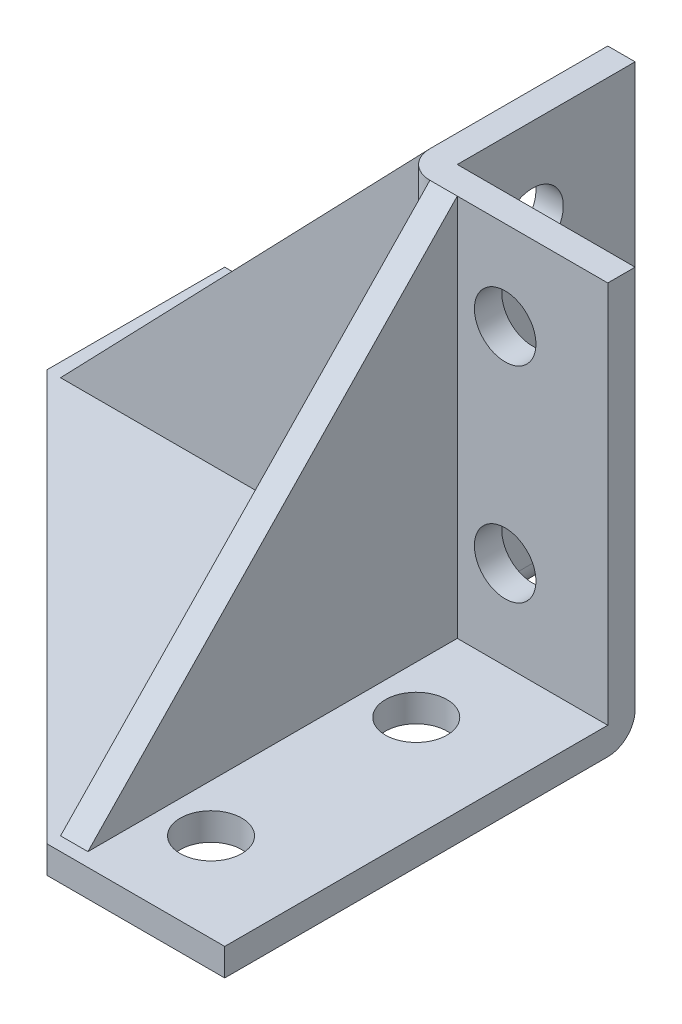
ISO-10303-21;
HEADER;
FILE_DESCRIPTION(('STEP AP214'),'2;1');
FILE_NAME('part.step','',(''),(''),'','','');
FILE_SCHEMA(('AUTOMOTIVE_DESIGN { 1 0 10303 214 1 1 1 1 }'));
ENDSEC;
DATA;
#1=APPLICATION_CONTEXT('core data for automotive mechanical design processes');
#2=APPLICATION_PROTOCOL_DEFINITION('international standard','automotive_design',2000,#1);
#3=PRODUCT_CONTEXT('',#1,'mechanical');
#4=PRODUCT('Part','Part','',(#3));
#5=PRODUCT_RELATED_PRODUCT_CATEGORY('part','',(#4));
#6=PRODUCT_DEFINITION_FORMATION('','',#4);
#7=PRODUCT_DEFINITION_CONTEXT('part definition',#1,'design');
#8=PRODUCT_DEFINITION('design','',#6,#7);
#9=PRODUCT_DEFINITION_SHAPE('','',#8);
#10=(LENGTH_UNIT() NAMED_UNIT(*) SI_UNIT(.MILLI.,.METRE.));
#11=(NAMED_UNIT(*) PLANE_ANGLE_UNIT() SI_UNIT($,.RADIAN.));
#12=(NAMED_UNIT(*) SI_UNIT($,.STERADIAN.) SOLID_ANGLE_UNIT());
#13=UNCERTAINTY_MEASURE_WITH_UNIT(LENGTH_MEASURE(1.E-05),#10,'distance_accuracy_value','');
#14=(GEOMETRIC_REPRESENTATION_CONTEXT(3) GLOBAL_UNCERTAINTY_ASSIGNED_CONTEXT((#13)) GLOBAL_UNIT_ASSIGNED_CONTEXT((#10,
#11,#12)) REPRESENTATION_CONTEXT('',''));
#15=CARTESIAN_POINT('',(0.,0.,0.));
#16=DIRECTION('',(0.,0.,1.));
#17=DIRECTION('',(1.,0.,0.));
#18=AXIS2_PLACEMENT_3D('',#15,#16,#17);
#19=CARTESIAN_POINT('',(0.,6.35,0.));
#20=DIRECTION('',(0.,-1.,0.));
#21=DIRECTION('',(0.,0.,-1.));
#22=AXIS2_PLACEMENT_3D('',#19,#20,#21);
#23=PLANE('',#22);
#24=CARTESIAN_POINT('',(-23.8125,6.35,115.8875));
#25=DIRECTION('',(0.,1.,0.));
#26=DIRECTION('',(0.,0.,1.));
#27=AXIS2_PLACEMENT_3D('',#24,#25,#26);
#28=CIRCLE('',#27,7.14374999999999);
#29=CARTESIAN_POINT('',(-23.8125,6.35,123.03125));
#30=VERTEX_POINT('',#29);
#31=EDGE_CURVE('E289',#30,#30,#28,.T.);
#32=ORIENTED_EDGE('',*,*,#31,.F.);
#33=EDGE_LOOP('',(#32));
#34=FACE_BOUND('',#33,.T.);
#35=CARTESIAN_POINT('',(-68.2625,6.35,23.8125));
#36=DIRECTION('',(0.,1.,0.));
#37=DIRECTION('',(0.,0.,1.));
#38=AXIS2_PLACEMENT_3D('',#35,#36,#37);
#39=CIRCLE('',#38,7.14375);
#40=CARTESIAN_POINT('',(-68.2625,6.35,30.95625));
#41=VERTEX_POINT('',#40);
#42=EDGE_CURVE('E592',#41,#41,#39,.T.);
#43=ORIENTED_EDGE('',*,*,#42,.F.);
#44=EDGE_LOOP('',(#43));
#45=FACE_BOUND('',#44,.T.);
#46=CARTESIAN_POINT('',(-115.8875,6.35,23.8125));
#47=DIRECTION('',(0.,1.,0.));
#48=DIRECTION('',(0.,0.,1.));
#49=AXIS2_PLACEMENT_3D('',#46,#47,#48);
#50=CIRCLE('',#49,7.14374999999999);
#51=CARTESIAN_POINT('',(-115.8875,6.35,30.95625));
#52=VERTEX_POINT('',#51);
#53=EDGE_CURVE('E578',#52,#52,#50,.T.);
#54=ORIENTED_EDGE('',*,*,#53,.F.);
#55=EDGE_LOOP('',(#54));
#56=FACE_BOUND('',#55,.T.);
#57=DIRECTION('',(-1.,0.,0.));
#58=VECTOR('',#57,1.);
#59=CARTESIAN_POINT('',(-34.9249999999999,6.35,133.35));
#60=LINE('',#59,#58);
#61=CARTESIAN_POINT('',(-34.925,6.35,133.35));
#62=VERTEX_POINT('',#61);
#63=CARTESIAN_POINT('',(-41.2749999999999,6.35,133.35));
#64=VERTEX_POINT('',#63);
#65=EDGE_CURVE('E211',#62,#64,#60,.T.);
#66=ORIENTED_EDGE('',*,*,#65,.T.);
#67=DIRECTION('',(0.,0.,-1.));
#68=VECTOR('',#67,1.);
#69=CARTESIAN_POINT('',(-41.275,6.35,47.625));
#70=LINE('',#69,#68);
#71=CARTESIAN_POINT('',(-41.275,6.35,47.625));
#72=VERTEX_POINT('',#71);
#73=EDGE_CURVE('E191',#64,#72,#70,.T.);
#74=ORIENTED_EDGE('',*,*,#73,.T.);
#75=CARTESIAN_POINT('',(-41.275,6.34999999999999,41.275));
#76=DIRECTION('',(0.,-1.,0.));
#77=DIRECTION('',(0.,0.,-1.));
#78=AXIS2_PLACEMENT_3D('',#75,#76,#77);
#79=CIRCLE('',#78,6.35);
#80=CARTESIAN_POINT('',(-47.625,6.35,41.275));
#81=VERTEX_POINT('',#80);
#82=EDGE_CURVE('E12',#72,#81,#79,.T.);
#83=ORIENTED_EDGE('',*,*,#82,.T.);
#84=DIRECTION('',(1.,0.,0.));
#85=VECTOR('',#84,1.);
#86=CARTESIAN_POINT('',(-47.625,6.35,41.275));
#87=LINE('',#86,#85);
#88=CARTESIAN_POINT('',(-133.35,6.35,41.275));
#89=VERTEX_POINT('',#88);
#90=EDGE_CURVE('E507',#89,#81,#87,.T.);
#91=ORIENTED_EDGE('',*,*,#90,.F.);
#92=DIRECTION('',(0.,0.,1.));
#93=VECTOR('',#92,1.);
#94=CARTESIAN_POINT('',(-133.35,6.35,34.925));
#95=LINE('',#94,#93);
#96=CARTESIAN_POINT('',(-133.35,6.35,34.925));
#97=VERTEX_POINT('',#96);
#98=EDGE_CURVE('E503',#97,#89,#95,.T.);
#99=ORIENTED_EDGE('',*,*,#98,.F.);
#100=DIRECTION('',(-1.,0.,0.));
#101=VECTOR('',#100,1.);
#102=CARTESIAN_POINT('',(-47.625,6.35,34.925));
#103=LINE('',#102,#101);
#104=CARTESIAN_POINT('',(-47.625,6.35,34.925));
#105=VERTEX_POINT('',#104);
#106=EDGE_CURVE('E495',#105,#97,#103,.T.);
#107=ORIENTED_EDGE('',*,*,#106,.F.);
#108=DIRECTION('',(0.,0.,1.));
#109=VECTOR('',#108,1.);
#110=CARTESIAN_POINT('',(-47.625,6.35,0.));
#111=LINE('',#110,#109);
#112=CARTESIAN_POINT('',(-47.625,6.35,0.));
#113=VERTEX_POINT('',#112);
#114=EDGE_CURVE('E368',#113,#105,#111,.T.);
#115=ORIENTED_EDGE('',*,*,#114,.F.);
#116=DIRECTION('',(-1.,0.,0.));
#117=VECTOR('',#116,1.);
#118=CARTESIAN_POINT('',(-136.525,6.35,0.));
#119=LINE('',#118,#117);
#120=CARTESIAN_POINT('',(-136.525,6.35,0.));
#121=VERTEX_POINT('',#120);
#122=EDGE_CURVE('E383',#113,#121,#119,.T.);
#123=ORIENTED_EDGE('',*,*,#122,.T.);
#124=DIRECTION('',(0.,0.,1.));
#125=VECTOR('',#124,1.);
#126=CARTESIAN_POINT('',(-136.525,6.35,41.275));
#127=LINE('',#126,#125);
#128=CARTESIAN_POINT('',(-136.525,6.35,41.275));
#129=VERTEX_POINT('',#128);
#130=EDGE_CURVE('E372',#121,#129,#127,.T.);
#131=ORIENTED_EDGE('',*,*,#130,.T.);
#132=DIRECTION('',(0.707106781186548,0.,0.707106781186547));
#133=VECTOR('',#132,1.);
#134=CARTESIAN_POINT('',(-41.275,6.35,136.525));
#135=LINE('',#134,#133);
#136=CARTESIAN_POINT('',(-41.275,6.35,136.525));
#137=VERTEX_POINT('',#136);
#138=EDGE_CURVE('E375',#129,#137,#135,.T.);
#139=ORIENTED_EDGE('',*,*,#138,.T.);
#140=DIRECTION('',(1.,0.,0.));
#141=VECTOR('',#140,1.);
#142=CARTESIAN_POINT('',(0.,6.35,136.525));
#143=LINE('',#142,#141);
#144=CARTESIAN_POINT('',(0.,6.35,136.525));
#145=VERTEX_POINT('',#144);
#146=EDGE_CURVE('E378',#137,#145,#143,.T.);
#147=ORIENTED_EDGE('',*,*,#146,.T.);
#148=DIRECTION('',(0.,0.,-1.));
#149=VECTOR('',#148,1.);
#150=CARTESIAN_POINT('',(0.,6.35,41.275));
#151=LINE('',#150,#149);
#152=CARTESIAN_POINT('',(0.,6.35,47.625));
#153=VERTEX_POINT('',#152);
#154=EDGE_CURVE('E380',#145,#153,#151,.T.);
#155=ORIENTED_EDGE('',*,*,#154,.T.);
#156=DIRECTION('',(-1.,0.,0.));
#157=VECTOR('',#156,1.);
#158=CARTESIAN_POINT('',(-41.275,6.35,47.625));
#159=LINE('',#158,#157);
#160=CARTESIAN_POINT('',(-34.925,6.35,47.625));
#161=VERTEX_POINT('',#160);
#162=EDGE_CURVE('E365',#153,#161,#159,.T.);
#163=ORIENTED_EDGE('',*,*,#162,.T.);
#164=DIRECTION('',(0.,0.,1.));
#165=VECTOR('',#164,1.);
#166=CARTESIAN_POINT('',(-34.925,6.35,47.625));
#167=LINE('',#166,#165);
#168=EDGE_CURVE('E209',#161,#62,#167,.T.);
#169=ORIENTED_EDGE('',*,*,#168,.T.);
#170=EDGE_LOOP('',(#66,#74,#83,#91,#99,#107,#115,#123,#131,#139,#147,#155,#163,#169));
#171=FACE_BOUND('',#170,.T.);
#172=CARTESIAN_POINT('',(-23.8125,6.35,68.2625));
#173=DIRECTION('',(0.,1.,0.));
#174=DIRECTION('',(0.,0.,1.));
#175=AXIS2_PLACEMENT_3D('',#172,#173,#174);
#176=CIRCLE('',#175,7.14374999999999);
#177=CARTESIAN_POINT('',(-23.8125,6.35,75.40625));
#178=VERTEX_POINT('',#177);
#179=EDGE_CURVE('E295',#178,#178,#176,.T.);
#180=ORIENTED_EDGE('',*,*,#179,.F.);
#181=EDGE_LOOP('',(#180));
#182=FACE_BOUND('',#181,.T.);
#183=ADVANCED_FACE('F48',(#34,#45,#56,#171,#182),#23,.F.);
#184=CARTESIAN_POINT('',(0.,0.,0.));
#185=DIRECTION('',(0.,-1.,0.));
#186=DIRECTION('',(0.,0.,-1.));
#187=AXIS2_PLACEMENT_3D('',#184,#185,#186);
#188=PLANE('',#187);
#189=CARTESIAN_POINT('',(-23.8125,0.,68.2625));
#190=DIRECTION('',(0.,1.,0.));
#191=DIRECTION('',(0.,0.,1.));
#192=AXIS2_PLACEMENT_3D('',#189,#190,#191);
#193=CIRCLE('',#192,7.14374999999999);
#194=CARTESIAN_POINT('',(-23.8125,0.,75.40625));
#195=VERTEX_POINT('',#194);
#196=EDGE_CURVE('E292',#195,#195,#193,.T.);
#197=ORIENTED_EDGE('',*,*,#196,.T.);
#198=EDGE_LOOP('',(#197));
#199=FACE_BOUND('',#198,.T.);
#200=DIRECTION('',(0.,0.,-1.));
#201=VECTOR('',#200,1.);
#202=CARTESIAN_POINT('',(-47.625,0.,41.275));
#203=LINE('',#202,#201);
#204=CARTESIAN_POINT('',(-47.625,0.,0.));
#205=VERTEX_POINT('',#204);
#206=CARTESIAN_POINT('',(-47.625,0.,47.625));
#207=VERTEX_POINT('',#206);
#208=EDGE_CURVE('E73',#205,#207,#203,.F.);
#209=ORIENTED_EDGE('',*,*,#208,.T.);
#210=DIRECTION('',(-1.,0.,0.));
#211=VECTOR('',#210,1.);
#212=CARTESIAN_POINT('',(0.,0.,47.625));
#213=LINE('',#212,#211);
#214=CARTESIAN_POINT('',(0.,0.,47.625));
#215=VERTEX_POINT('',#214);
#216=EDGE_CURVE('E317',#207,#215,#213,.F.);
#217=ORIENTED_EDGE('',*,*,#216,.T.);
#218=DIRECTION('',(0.,0.,-1.));
#219=VECTOR('',#218,1.);
#220=CARTESIAN_POINT('',(0.,0.,41.275));
#221=LINE('',#220,#219);
#222=CARTESIAN_POINT('',(0.,0.,136.525));
#223=VERTEX_POINT('',#222);
#224=EDGE_CURVE('E411',#223,#215,#221,.T.);
#225=ORIENTED_EDGE('',*,*,#224,.F.);
#226=DIRECTION('',(1.,0.,0.));
#227=VECTOR('',#226,1.);
#228=CARTESIAN_POINT('',(0.,0.,136.525));
#229=LINE('',#228,#227);
#230=CARTESIAN_POINT('',(-41.275,0.,136.525));
#231=VERTEX_POINT('',#230);
#232=EDGE_CURVE('E406',#231,#223,#229,.T.);
#233=ORIENTED_EDGE('',*,*,#232,.F.);
#234=DIRECTION('',(0.707106781186548,0.,0.707106781186547));
#235=VECTOR('',#234,1.);
#236=CARTESIAN_POINT('',(-41.275,0.,136.525));
#237=LINE('',#236,#235);
#238=CARTESIAN_POINT('',(-136.525,0.,41.275));
#239=VERTEX_POINT('',#238);
#240=EDGE_CURVE('E401',#239,#231,#237,.T.);
#241=ORIENTED_EDGE('',*,*,#240,.F.);
#242=DIRECTION('',(0.,0.,1.));
#243=VECTOR('',#242,1.);
#244=CARTESIAN_POINT('',(-136.525,0.,41.275));
#245=LINE('',#244,#243);
#246=CARTESIAN_POINT('',(-136.525,0.,0.));
#247=VERTEX_POINT('',#246);
#248=EDGE_CURVE('E386',#247,#239,#245,.T.);
#249=ORIENTED_EDGE('',*,*,#248,.F.);
#250=DIRECTION('',(-1.,0.,0.));
#251=VECTOR('',#250,1.);
#252=CARTESIAN_POINT('',(-136.525,0.,0.));
#253=LINE('',#252,#251);
#254=EDGE_CURVE('E376',#205,#247,#253,.T.);
#255=ORIENTED_EDGE('',*,*,#254,.F.);
#256=EDGE_LOOP('',(#209,#217,#225,#233,#241,#249,#255));
#257=FACE_BOUND('',#256,.T.);
#258=CARTESIAN_POINT('',(-115.8875,0.,23.8125));
#259=DIRECTION('',(0.,-1.,0.));
#260=DIRECTION('',(0.,0.,-1.));
#261=AXIS2_PLACEMENT_3D('',#258,#259,#260);
#262=CIRCLE('',#261,7.14374999999999);
#263=CARTESIAN_POINT('',(-115.8875,0.,16.66875));
#264=VERTEX_POINT('',#263);
#265=EDGE_CURVE('E575',#264,#264,#262,.T.);
#266=ORIENTED_EDGE('',*,*,#265,.F.);
#267=EDGE_LOOP('',(#266));
#268=FACE_BOUND('',#267,.T.);
#269=CARTESIAN_POINT('',(-68.2625,0.,23.8125));
#270=DIRECTION('',(0.,-1.,0.));
#271=DIRECTION('',(0.,0.,-1.));
#272=AXIS2_PLACEMENT_3D('',#269,#270,#271);
#273=CIRCLE('',#272,7.14374999999999);
#274=CARTESIAN_POINT('',(-68.2625,0.,16.66875));
#275=VERTEX_POINT('',#274);
#276=EDGE_CURVE('E589',#275,#275,#273,.T.);
#277=ORIENTED_EDGE('',*,*,#276,.F.);
#278=EDGE_LOOP('',(#277));
#279=FACE_BOUND('',#278,.T.);
#280=CARTESIAN_POINT('',(-23.8125,0.,115.8875));
#281=DIRECTION('',(0.,1.,0.));
#282=DIRECTION('',(0.,0.,1.));
#283=AXIS2_PLACEMENT_3D('',#280,#281,#282);
#284=CIRCLE('',#283,7.14374999999999);
#285=CARTESIAN_POINT('',(-23.8125,0.,123.03125));
#286=VERTEX_POINT('',#285);
#287=EDGE_CURVE('E223',#286,#286,#284,.T.);
#288=ORIENTED_EDGE('',*,*,#287,.T.);
#289=EDGE_LOOP('',(#288));
#290=FACE_BOUND('',#289,.T.);
#291=ADVANCED_FACE('F433',(#199,#257,#268,#279,#290),#188,.T.);
#292=CARTESIAN_POINT('',(-41.275,6.35,0.));
#293=DIRECTION('',(-1.,0.,0.));
#294=DIRECTION('',(0.,0.,1.));
#295=AXIS2_PLACEMENT_3D('',#292,#293,#294);
#296=PLANE('',#295);
#297=CARTESIAN_POINT('',(-41.275,26.9875,23.8125));
#298=DIRECTION('',(-1.,0.,0.));
#299=DIRECTION('',(0.,0.,1.));
#300=AXIS2_PLACEMENT_3D('',#297,#298,#299);
#301=CIRCLE('',#300,7.14374999999999);
#302=CARTESIAN_POINT('',(-41.275,26.9875,30.95625));
#303=VERTEX_POINT('',#302);
#304=EDGE_CURVE('E583',#303,#303,#301,.T.);
#305=ORIENTED_EDGE('',*,*,#304,.T.);
#306=EDGE_LOOP('',(#305));
#307=FACE_BOUND('',#306,.T.);
#308=CARTESIAN_POINT('',(-41.275,74.6125,23.8125));
#309=DIRECTION('',(-1.,0.,0.));
#310=DIRECTION('',(0.,0.,1.));
#311=AXIS2_PLACEMENT_3D('',#308,#309,#310);
#312=CIRCLE('',#311,7.14374999999999);
#313=CARTESIAN_POINT('',(-41.275,74.6125,30.95625));
#314=VERTEX_POINT('',#313);
#315=EDGE_CURVE('E363',#314,#314,#312,.T.);
#316=ORIENTED_EDGE('',*,*,#315,.T.);
#317=EDGE_LOOP('',(#316));
#318=FACE_BOUND('',#317,.T.);
#319=DIRECTION('',(0.,-1.,0.));
#320=VECTOR('',#319,1.);
#321=CARTESIAN_POINT('',(-41.275,6.35,41.275));
#322=LINE('',#321,#320);
#323=CARTESIAN_POINT('',(-41.275,95.25,41.275));
#324=VERTEX_POINT('',#323);
#325=CARTESIAN_POINT('',(-41.275,6.35,41.275));
#326=VERTEX_POINT('',#325);
#327=EDGE_CURVE('E326',#324,#326,#322,.T.);
#328=ORIENTED_EDGE('',*,*,#327,.T.);
#329=DIRECTION('',(0.,0.,-1.));
#330=VECTOR('',#329,1.);
#331=CARTESIAN_POINT('',(-41.275,6.35,0.));
#332=LINE('',#331,#330);
#333=CARTESIAN_POINT('',(-41.275,6.35,0.));
#334=VERTEX_POINT('',#333);
#335=EDGE_CURVE('E65',#326,#334,#332,.T.);
#336=ORIENTED_EDGE('',*,*,#335,.T.);
#337=DIRECTION('',(0.,-1.,0.));
#338=VECTOR('',#337,1.);
#339=CARTESIAN_POINT('',(-41.275,6.35,0.));
#340=LINE('',#339,#338);
#341=CARTESIAN_POINT('',(-41.275,95.25,0.));
#342=VERTEX_POINT('',#341);
#343=EDGE_CURVE('E334',#342,#334,#340,.T.);
#344=ORIENTED_EDGE('',*,*,#343,.F.);
#345=DIRECTION('',(0.,0.,1.));
#346=VECTOR('',#345,1.);
#347=CARTESIAN_POINT('',(-41.275,95.25,0.));
#348=LINE('',#347,#346);
#349=EDGE_CURVE('E333',#342,#324,#348,.T.);
#350=ORIENTED_EDGE('',*,*,#349,.T.);
#351=EDGE_LOOP('',(#328,#336,#344,#350));
#352=FACE_BOUND('',#351,.T.);
#353=ADVANCED_FACE('F331',(#307,#318,#352),#296,.F.);
#354=CARTESIAN_POINT('',(-136.525,6.35,41.275));
#355=DIRECTION('',(1.,0.,0.));
#356=DIRECTION('',(0.,0.,-1.));
#357=AXIS2_PLACEMENT_3D('',#354,#355,#356);
#358=PLANE('',#357);
#359=ORIENTED_EDGE('',*,*,#248,.T.);
#360=DIRECTION('',(0.,-1.,0.));
#361=VECTOR('',#360,1.);
#362=CARTESIAN_POINT('',(-136.525,6.35,41.275));
#363=LINE('',#362,#361);
#364=EDGE_CURVE('E180',#129,#239,#363,.T.);
#365=ORIENTED_EDGE('',*,*,#364,.F.);
#366=ORIENTED_EDGE('',*,*,#130,.F.);
#367=DIRECTION('',(0.,-1.,0.));
#368=VECTOR('',#367,1.);
#369=CARTESIAN_POINT('',(-136.525,6.35,0.));
#370=LINE('',#369,#368);
#371=EDGE_CURVE('E338',#121,#247,#370,.T.);
#372=ORIENTED_EDGE('',*,*,#371,.T.);
#373=EDGE_LOOP('',(#359,#365,#366,#372));
#374=FACE_BOUND('',#373,.T.);
#375=ADVANCED_FACE('F425',(#374),#358,.F.);
#376=CARTESIAN_POINT('',(-41.275,6.35,136.525));
#377=DIRECTION('',(0.707106781186547,0.,-0.707106781186548));
#378=DIRECTION('',(-0.707106781186548,0.,-0.707106781186547));
#379=AXIS2_PLACEMENT_3D('',#376,#377,#378);
#380=PLANE('',#379);
#381=ORIENTED_EDGE('',*,*,#240,.T.);
#382=DIRECTION('',(0.,-1.,0.));
#383=VECTOR('',#382,1.);
#384=CARTESIAN_POINT('',(-41.275,6.35,136.525));
#385=LINE('',#384,#383);
#386=EDGE_CURVE('E419',#137,#231,#385,.T.);
#387=ORIENTED_EDGE('',*,*,#386,.F.);
#388=ORIENTED_EDGE('',*,*,#138,.F.);
#389=ORIENTED_EDGE('',*,*,#364,.T.);
#390=EDGE_LOOP('',(#381,#387,#388,#389));
#391=FACE_BOUND('',#390,.T.);
#392=ADVANCED_FACE('F423',(#391),#380,.F.);
#393=CARTESIAN_POINT('',(0.,6.35,136.525));
#394=DIRECTION('',(0.,0.,-1.));
#395=DIRECTION('',(-1.,0.,0.));
#396=AXIS2_PLACEMENT_3D('',#393,#394,#395);
#397=PLANE('',#396);
#398=ORIENTED_EDGE('',*,*,#232,.T.);
#399=DIRECTION('',(0.,-1.,0.));
#400=VECTOR('',#399,1.);
#401=CARTESIAN_POINT('',(0.,6.35,136.525));
#402=LINE('',#401,#400);
#403=EDGE_CURVE('E336',#145,#223,#402,.T.);
#404=ORIENTED_EDGE('',*,*,#403,.F.);
#405=ORIENTED_EDGE('',*,*,#146,.F.);
#406=ORIENTED_EDGE('',*,*,#386,.T.);
#407=EDGE_LOOP('',(#398,#404,#405,#406));
#408=FACE_BOUND('',#407,.T.);
#409=ADVANCED_FACE('F447',(#408),#397,.F.);
#410=CARTESIAN_POINT('',(0.,6.35,41.275));
#411=DIRECTION('',(-1.,0.,0.));
#412=DIRECTION('',(0.,0.,1.));
#413=AXIS2_PLACEMENT_3D('',#410,#411,#412);
#414=PLANE('',#413);
#415=ORIENTED_EDGE('',*,*,#224,.T.);
#416=CARTESIAN_POINT('',(0.,6.35,47.625));
#417=DIRECTION('',(-1.,0.,0.));
#418=DIRECTION('',(0.,0.,1.));
#419=AXIS2_PLACEMENT_3D('',#416,#417,#418);
#420=CIRCLE('',#419,6.35);
#421=CARTESIAN_POINT('',(0.,6.35,41.275));
#422=VERTEX_POINT('',#421);
#423=EDGE_CURVE('E320',#215,#422,#420,.F.);
#424=ORIENTED_EDGE('',*,*,#423,.T.);
#425=DIRECTION('',(0.,-1.,0.));
#426=VECTOR('',#425,1.);
#427=CARTESIAN_POINT('',(0.,6.35,41.275));
#428=LINE('',#427,#426);
#429=CARTESIAN_POINT('',(0.,95.25,41.275));
#430=VERTEX_POINT('',#429);
#431=EDGE_CURVE('E328',#430,#422,#428,.T.);
#432=ORIENTED_EDGE('',*,*,#431,.F.);
#433=DIRECTION('',(0.,0.,1.));
#434=VECTOR('',#433,1.);
#435=CARTESIAN_POINT('',(0.,95.25,41.275));
#436=LINE('',#435,#434);
#437=CARTESIAN_POINT('',(0.,95.25,47.625));
#438=VERTEX_POINT('',#437);
#439=EDGE_CURVE('E452',#430,#438,#436,.T.);
#440=ORIENTED_EDGE('',*,*,#439,.T.);
#441=DIRECTION('',(0.,-1.,0.));
#442=VECTOR('',#441,1.);
#443=CARTESIAN_POINT('',(0.,95.25,47.625));
#444=LINE('',#443,#442);
#445=EDGE_CURVE('E450',#438,#153,#444,.T.);
#446=ORIENTED_EDGE('',*,*,#445,.T.);
#447=ORIENTED_EDGE('',*,*,#154,.F.);
#448=ORIENTED_EDGE('',*,*,#403,.T.);
#449=EDGE_LOOP('',(#415,#424,#432,#440,#446,#447,#448));
#450=FACE_BOUND('',#449,.T.);
#451=ADVANCED_FACE('F442',(#450),#414,.F.);
#452=CARTESIAN_POINT('',(-41.275,6.35,41.275));
#453=DIRECTION('',(0.,0.,1.));
#454=DIRECTION('',(1.,0.,0.));
#455=AXIS2_PLACEMENT_3D('',#452,#453,#454);
#456=PLANE('',#455);
#457=CARTESIAN_POINT('',(-23.8125,74.6125,41.275));
#458=DIRECTION('',(0.,0.,1.));
#459=DIRECTION('',(1.,0.,0.));
#460=AXIS2_PLACEMENT_3D('',#457,#458,#459);
#461=CIRCLE('',#460,7.14374999999999);
#462=CARTESIAN_POINT('',(-16.66875,74.6125,41.275));
#463=VERTEX_POINT('',#462);
#464=EDGE_CURVE('E304',#463,#463,#461,.T.);
#465=ORIENTED_EDGE('',*,*,#464,.T.);
#466=EDGE_LOOP('',(#465));
#467=FACE_BOUND('',#466,.T.);
#468=CARTESIAN_POINT('',(-23.8125,26.9875,41.275));
#469=DIRECTION('',(0.,0.,1.));
#470=DIRECTION('',(1.,0.,0.));
#471=AXIS2_PLACEMENT_3D('',#468,#469,#470);
#472=CIRCLE('',#471,7.14374999999999);
#473=CARTESIAN_POINT('',(-16.66875,26.9875,41.275));
#474=VERTEX_POINT('',#473);
#475=EDGE_CURVE('E298',#474,#474,#472,.T.);
#476=ORIENTED_EDGE('',*,*,#475,.T.);
#477=EDGE_LOOP('',(#476));
#478=FACE_BOUND('',#477,.T.);
#479=ORIENTED_EDGE('',*,*,#431,.T.);
#480=DIRECTION('',(-1.,0.,0.));
#481=VECTOR('',#480,1.);
#482=CARTESIAN_POINT('',(-41.275,6.35,41.275));
#483=LINE('',#482,#481);
#484=EDGE_CURVE('E179',#422,#326,#483,.T.);
#485=ORIENTED_EDGE('',*,*,#484,.T.);
#486=ORIENTED_EDGE('',*,*,#327,.F.);
#487=DIRECTION('',(-1.,0.,0.));
#488=VECTOR('',#487,1.);
#489=CARTESIAN_POINT('',(0.,95.25,41.275));
#490=LINE('',#489,#488);
#491=EDGE_CURVE('E453',#430,#324,#490,.T.);
#492=ORIENTED_EDGE('',*,*,#491,.F.);
#493=EDGE_LOOP('',(#479,#485,#486,#492));
#494=FACE_BOUND('',#493,.T.);
#495=ADVANCED_FACE('F324',(#467,#478,#494),#456,.F.);
#496=CARTESIAN_POINT('',(-136.525,6.35,0.));
#497=DIRECTION('',(0.,0.,1.));
#498=DIRECTION('',(1.,0.,0.));
#499=AXIS2_PLACEMENT_3D('',#496,#497,#498);
#500=PLANE('',#499);
#501=ORIENTED_EDGE('',*,*,#343,.T.);
#502=CARTESIAN_POINT('',(-47.625,6.35,0.));
#503=DIRECTION('',(0.,0.,1.));
#504=DIRECTION('',(1.,0.,0.));
#505=AXIS2_PLACEMENT_3D('',#502,#503,#504);
#506=CIRCLE('',#505,6.35);
#507=EDGE_CURVE('E57',#334,#205,#506,.F.);
#508=ORIENTED_EDGE('',*,*,#507,.T.);
#509=ORIENTED_EDGE('',*,*,#254,.T.);
#510=ORIENTED_EDGE('',*,*,#371,.F.);
#511=ORIENTED_EDGE('',*,*,#122,.F.);
#512=DIRECTION('',(0.,-1.,0.));
#513=VECTOR('',#512,1.);
#514=CARTESIAN_POINT('',(-47.625,95.25,0.));
#515=LINE('',#514,#513);
#516=CARTESIAN_POINT('',(-47.625,95.25,0.));
#517=VERTEX_POINT('',#516);
#518=EDGE_CURVE('E396',#517,#113,#515,.T.);
#519=ORIENTED_EDGE('',*,*,#518,.F.);
#520=DIRECTION('',(-1.,0.,0.));
#521=VECTOR('',#520,1.);
#522=CARTESIAN_POINT('',(-41.275,95.25,0.));
#523=LINE('',#522,#521);
#524=EDGE_CURVE('E350',#342,#517,#523,.T.);
#525=ORIENTED_EDGE('',*,*,#524,.F.);
#526=EDGE_LOOP('',(#501,#508,#509,#510,#511,#519,#525));
#527=FACE_BOUND('',#526,.T.);
#528=ADVANCED_FACE('F432',(#527),#500,.F.);
#529=CARTESIAN_POINT('',(-47.625,95.25,0.));
#530=DIRECTION('',(1.,0.,0.));
#531=DIRECTION('',(0.,0.,-1.));
#532=AXIS2_PLACEMENT_3D('',#529,#530,#531);
#533=PLANE('',#532);
#534=CARTESIAN_POINT('',(-47.625,74.6125,23.8125));
#535=DIRECTION('',(-1.,0.,0.));
#536=DIRECTION('',(0.,0.,1.));
#537=AXIS2_PLACEMENT_3D('',#534,#535,#536);
#538=CIRCLE('',#537,7.14374999999999);
#539=CARTESIAN_POINT('',(-47.625,74.6125,30.95625));
#540=VERTEX_POINT('',#539);
#541=EDGE_CURVE('E598',#540,#540,#538,.T.);
#542=ORIENTED_EDGE('',*,*,#541,.F.);
#543=EDGE_LOOP('',(#542));
#544=FACE_BOUND('',#543,.T.);
#545=CARTESIAN_POINT('',(-47.625,26.9875,23.8125));
#546=DIRECTION('',(-1.,0.,0.));
#547=DIRECTION('',(0.,0.,1.));
#548=AXIS2_PLACEMENT_3D('',#545,#546,#547);
#549=CIRCLE('',#548,7.14375);
#550=CARTESIAN_POINT('',(-47.625,26.9875,30.95625));
#551=VERTEX_POINT('',#550);
#552=EDGE_CURVE('E595',#551,#551,#549,.T.);
#553=ORIENTED_EDGE('',*,*,#552,.F.);
#554=EDGE_LOOP('',(#553));
#555=FACE_BOUND('',#554,.T.);
#556=ORIENTED_EDGE('',*,*,#114,.T.);
#557=DIRECTION('',(0.,-1.,0.));
#558=VECTOR('',#557,1.);
#559=CARTESIAN_POINT('',(-47.625,6.35,34.925));
#560=LINE('',#559,#558);
#561=CARTESIAN_POINT('',(-47.625,95.25,34.925));
#562=VERTEX_POINT('',#561);
#563=EDGE_CURVE('E394',#562,#105,#560,.T.);
#564=ORIENTED_EDGE('',*,*,#563,.F.);
#565=DIRECTION('',(0.,0.,1.));
#566=VECTOR('',#565,1.);
#567=CARTESIAN_POINT('',(-47.625,95.25,0.));
#568=LINE('',#567,#566);
#569=EDGE_CURVE('E346',#517,#562,#568,.T.);
#570=ORIENTED_EDGE('',*,*,#569,.F.);
#571=ORIENTED_EDGE('',*,*,#518,.T.);
#572=EDGE_LOOP('',(#556,#564,#570,#571));
#573=FACE_BOUND('',#572,.T.);
#574=ADVANCED_FACE('F474',(#544,#555,#573),#533,.F.);
#575=CARTESIAN_POINT('',(-41.275,95.25,47.625));
#576=DIRECTION('',(0.,0.,1.));
#577=DIRECTION('',(1.,0.,0.));
#578=AXIS2_PLACEMENT_3D('',#575,#576,#577);
#579=PLANE('',#578);
#580=CARTESIAN_POINT('',(-23.8125,74.6125,47.625));
#581=DIRECTION('',(0.,0.,1.));
#582=DIRECTION('',(1.,0.,0.));
#583=AXIS2_PLACEMENT_3D('',#580,#581,#582);
#584=CIRCLE('',#583,7.14374999999999);
#585=CARTESIAN_POINT('',(-16.66875,74.6125,47.625));
#586=VERTEX_POINT('',#585);
#587=EDGE_CURVE('E307',#586,#586,#584,.T.);
#588=ORIENTED_EDGE('',*,*,#587,.F.);
#589=EDGE_LOOP('',(#588));
#590=FACE_BOUND('',#589,.T.);
#591=CARTESIAN_POINT('',(-23.8125,26.9875,47.625));
#592=DIRECTION('',(0.,0.,1.));
#593=DIRECTION('',(1.,0.,0.));
#594=AXIS2_PLACEMENT_3D('',#591,#592,#593);
#595=CIRCLE('',#594,7.14374999999999);
#596=CARTESIAN_POINT('',(-16.66875,26.9875,47.625));
#597=VERTEX_POINT('',#596);
#598=EDGE_CURVE('E301',#597,#597,#595,.T.);
#599=ORIENTED_EDGE('',*,*,#598,.F.);
#600=EDGE_LOOP('',(#599));
#601=FACE_BOUND('',#600,.T.);
#602=DIRECTION('',(0.,-1.,0.));
#603=VECTOR('',#602,1.);
#604=CARTESIAN_POINT('',(-34.925,6.35,47.625));
#605=LINE('',#604,#603);
#606=CARTESIAN_POINT('',(-34.925,95.25,47.625));
#607=VERTEX_POINT('',#606);
#608=EDGE_CURVE('E205',#607,#161,#605,.T.);
#609=ORIENTED_EDGE('',*,*,#608,.T.);
#610=ORIENTED_EDGE('',*,*,#162,.F.);
#611=ORIENTED_EDGE('',*,*,#445,.F.);
#612=DIRECTION('',(-1.,0.,0.));
#613=VECTOR('',#612,1.);
#614=CARTESIAN_POINT('',(-41.275,95.25,47.625));
#615=LINE('',#614,#613);
#616=EDGE_CURVE('E349',#438,#607,#615,.T.);
#617=ORIENTED_EDGE('',*,*,#616,.T.);
#618=EDGE_LOOP('',(#609,#610,#611,#617));
#619=FACE_BOUND('',#618,.T.);
#620=ADVANCED_FACE('F468',(#590,#601,#619),#579,.T.);
#621=CARTESIAN_POINT('',(0.,95.25,0.));
#622=DIRECTION('',(0.,1.,0.));
#623=DIRECTION('',(0.,0.,1.));
#624=AXIS2_PLACEMENT_3D('',#621,#622,#623);
#625=PLANE('',#624);
#626=DIRECTION('',(0.,0.,-1.));
#627=VECTOR('',#626,1.);
#628=CARTESIAN_POINT('',(-47.625,95.25,41.275));
#629=LINE('',#628,#627);
#630=CARTESIAN_POINT('',(-47.625,95.25,41.275));
#631=VERTEX_POINT('',#630);
#632=EDGE_CURVE('E175',#631,#562,#629,.T.);
#633=ORIENTED_EDGE('',*,*,#632,.F.);
#634=CARTESIAN_POINT('',(-41.275,95.25,41.275));
#635=DIRECTION('',(0.,1.,0.));
#636=DIRECTION('',(0.,0.,1.));
#637=AXIS2_PLACEMENT_3D('',#634,#635,#636);
#638=CIRCLE('',#637,6.35);
#639=CARTESIAN_POINT('',(-41.275,95.25,47.625));
#640=VERTEX_POINT('',#639);
#641=EDGE_CURVE('E167',#631,#640,#638,.T.);
#642=ORIENTED_EDGE('',*,*,#641,.T.);
#643=DIRECTION('',(1.,0.,0.));
#644=VECTOR('',#643,1.);
#645=CARTESIAN_POINT('',(-41.275,95.25,47.625));
#646=LINE('',#645,#644);
#647=EDGE_CURVE('E171',#640,#607,#646,.T.);
#648=ORIENTED_EDGE('',*,*,#647,.T.);
#649=ORIENTED_EDGE('',*,*,#616,.F.);
#650=ORIENTED_EDGE('',*,*,#439,.F.);
#651=ORIENTED_EDGE('',*,*,#491,.T.);
#652=ORIENTED_EDGE('',*,*,#349,.F.);
#653=ORIENTED_EDGE('',*,*,#524,.T.);
#654=ORIENTED_EDGE('',*,*,#569,.T.);
#655=EDGE_LOOP('',(#633,#642,#648,#649,#650,#651,#652,#653,#654));
#656=FACE_BOUND('',#655,.T.);
#657=ADVANCED_FACE('F169',(#656),#625,.T.);
#658=CARTESIAN_POINT('',(-47.625,6.35,41.275));
#659=DIRECTION('',(0.,0.,1.));
#660=DIRECTION('',(0.,1.,0.));
#661=AXIS2_PLACEMENT_3D('',#658,#659,#660);
#662=PLANE('',#661);
#663=DIRECTION('',(0.,1.,0.));
#664=VECTOR('',#663,1.);
#665=CARTESIAN_POINT('',(-47.625,6.35,41.275));
#666=LINE('',#665,#664);
#667=EDGE_CURVE('E502',#81,#631,#666,.T.);
#668=ORIENTED_EDGE('',*,*,#667,.T.);
#669=DIRECTION('',(-0.694135570584232,-0.719844295420685,0.));
#670=VECTOR('',#669,1.);
#671=CARTESIAN_POINT('',(-90.4875,50.8,41.275));
#672=LINE('',#671,#670);
#673=EDGE_CURVE('E282',#631,#89,#672,.T.);
#674=ORIENTED_EDGE('',*,*,#673,.T.);
#675=ORIENTED_EDGE('',*,*,#90,.T.);
#676=EDGE_LOOP('',(#668,#674,#675));
#677=FACE_BOUND('',#676,.T.);
#678=ADVANCED_FACE('F467',(#677),#662,.T.);
#679=CARTESIAN_POINT('',(-72.2716457369464,69.6905155320555,0.));
#680=DIRECTION('',(-0.719844295420685,0.694135570584232,0.));
#681=DIRECTION('',(-0.694135570584232,-0.719844295420685,0.));
#682=AXIS2_PLACEMENT_3D('',#679,#680,#681);
#683=PLANE('',#682);
#684=DIRECTION('',(-0.694135570584232,-0.719844295420685,0.));
#685=VECTOR('',#684,1.);
#686=CARTESIAN_POINT('',(-47.625,95.25,34.925));
#687=LINE('',#686,#685);
#688=EDGE_CURVE('E523',#562,#97,#687,.T.);
#689=ORIENTED_EDGE('',*,*,#688,.T.);
#690=ORIENTED_EDGE('',*,*,#98,.T.);
#691=ORIENTED_EDGE('',*,*,#673,.F.);
#692=ORIENTED_EDGE('',*,*,#632,.T.);
#693=EDGE_LOOP('',(#689,#690,#691,#692));
#694=FACE_BOUND('',#693,.T.);
#695=ADVANCED_FACE('F529',(#694),#683,.T.);
#696=CARTESIAN_POINT('',(-47.625,95.25,34.925));
#697=DIRECTION('',(0.,0.,-1.));
#698=DIRECTION('',(0.,-1.,0.));
#699=AXIS2_PLACEMENT_3D('',#696,#697,#698);
#700=PLANE('',#699);
#701=ORIENTED_EDGE('',*,*,#563,.T.);
#702=ORIENTED_EDGE('',*,*,#106,.T.);
#703=ORIENTED_EDGE('',*,*,#688,.F.);
#704=EDGE_LOOP('',(#701,#702,#703));
#705=FACE_BOUND('',#704,.T.);
#706=ADVANCED_FACE('F469',(#705),#700,.T.);
#707=CARTESIAN_POINT('',(-115.8875,6.35,23.8125));
#708=DIRECTION('',(0.,1.,0.));
#709=DIRECTION('',(0.,0.,1.));
#710=AXIS2_PLACEMENT_3D('',#707,#708,#709);
#711=CYLINDRICAL_SURFACE('',#710,7.14374999999999);
#712=ORIENTED_EDGE('',*,*,#265,.T.);
#713=EDGE_LOOP('',(#712));
#714=FACE_BOUND('',#713,.T.);
#715=ORIENTED_EDGE('',*,*,#53,.T.);
#716=EDGE_LOOP('',(#715));
#717=FACE_BOUND('',#716,.T.);
#718=ADVANCED_FACE('F616',(#714,#717),#711,.F.);
#719=CARTESIAN_POINT('',(-68.2625,6.35,23.8125));
#720=DIRECTION('',(0.,1.,0.));
#721=DIRECTION('',(0.,0.,1.));
#722=AXIS2_PLACEMENT_3D('',#719,#720,#721);
#723=CYLINDRICAL_SURFACE('',#722,7.14374999999999);
#724=ORIENTED_EDGE('',*,*,#276,.T.);
#725=EDGE_LOOP('',(#724));
#726=FACE_BOUND('',#725,.T.);
#727=ORIENTED_EDGE('',*,*,#42,.T.);
#728=EDGE_LOOP('',(#727));
#729=FACE_BOUND('',#728,.T.);
#730=ADVANCED_FACE('F620',(#726,#729),#723,.F.);
#731=CARTESIAN_POINT('',(-47.625,26.9875,23.8125));
#732=DIRECTION('',(-1.,0.,0.));
#733=DIRECTION('',(0.,0.,1.));
#734=AXIS2_PLACEMENT_3D('',#731,#732,#733);
#735=CYLINDRICAL_SURFACE('',#734,7.14374999999999);
#736=ORIENTED_EDGE('',*,*,#552,.T.);
#737=EDGE_LOOP('',(#736));
#738=FACE_BOUND('',#737,.T.);
#739=ORIENTED_EDGE('',*,*,#304,.F.);
#740=EDGE_LOOP('',(#739));
#741=FACE_BOUND('',#740,.T.);
#742=ADVANCED_FACE('F625',(#738,#741),#735,.F.);
#743=CARTESIAN_POINT('',(-47.625,74.6125,23.8125));
#744=DIRECTION('',(-1.,0.,0.));
#745=DIRECTION('',(0.,0.,1.));
#746=AXIS2_PLACEMENT_3D('',#743,#744,#745);
#747=CYLINDRICAL_SURFACE('',#746,7.14374999999999);
#748=ORIENTED_EDGE('',*,*,#541,.T.);
#749=EDGE_LOOP('',(#748));
#750=FACE_BOUND('',#749,.T.);
#751=ORIENTED_EDGE('',*,*,#315,.F.);
#752=EDGE_LOOP('',(#751));
#753=FACE_BOUND('',#752,.T.);
#754=ADVANCED_FACE('F631',(#750,#753),#747,.F.);
#755=CARTESIAN_POINT('',(-41.275,6.35,47.625));
#756=DIRECTION('',(-1.,0.,0.));
#757=DIRECTION('',(0.,1.,0.));
#758=AXIS2_PLACEMENT_3D('',#755,#756,#757);
#759=PLANE('',#758);
#760=DIRECTION('',(0.,1.,0.));
#761=VECTOR('',#760,1.);
#762=CARTESIAN_POINT('',(-41.275,6.35,47.625));
#763=LINE('',#762,#761);
#764=EDGE_CURVE('E189',#72,#640,#763,.T.);
#765=ORIENTED_EDGE('',*,*,#764,.F.);
#766=ORIENTED_EDGE('',*,*,#73,.F.);
#767=DIRECTION('',(0.,-0.719844295420685,0.694135570584232));
#768=VECTOR('',#767,1.);
#769=CARTESIAN_POINT('',(-41.275,50.8,90.4875));
#770=LINE('',#769,#768);
#771=EDGE_CURVE('E186',#640,#64,#770,.T.);
#772=ORIENTED_EDGE('',*,*,#771,.F.);
#773=EDGE_LOOP('',(#765,#766,#772));
#774=FACE_BOUND('',#773,.T.);
#775=ADVANCED_FACE('F188',(#774),#759,.T.);
#776=CARTESIAN_POINT('',(0.,69.6905155320555,72.2716457369464));
#777=DIRECTION('',(0.,0.694135570584232,0.719844295420685));
#778=DIRECTION('',(0.,-0.719844295420685,0.694135570584232));
#779=AXIS2_PLACEMENT_3D('',#776,#777,#778);
#780=PLANE('',#779);
#781=DIRECTION('',(0.,-0.719844295420685,0.694135570584232));
#782=VECTOR('',#781,1.);
#783=CARTESIAN_POINT('',(-34.925,95.25,47.625));
#784=LINE('',#783,#782);
#785=EDGE_CURVE('E195',#607,#62,#784,.T.);
#786=ORIENTED_EDGE('',*,*,#785,.F.);
#787=ORIENTED_EDGE('',*,*,#647,.F.);
#788=ORIENTED_EDGE('',*,*,#771,.T.);
#789=ORIENTED_EDGE('',*,*,#65,.F.);
#790=EDGE_LOOP('',(#786,#787,#788,#789));
#791=FACE_BOUND('',#790,.T.);
#792=ADVANCED_FACE('F201',(#791),#780,.T.);
#793=CARTESIAN_POINT('',(-34.925,95.25,47.625));
#794=DIRECTION('',(1.,0.,0.));
#795=DIRECTION('',(0.,-1.,0.));
#796=AXIS2_PLACEMENT_3D('',#793,#794,#795);
#797=PLANE('',#796);
#798=ORIENTED_EDGE('',*,*,#608,.F.);
#799=ORIENTED_EDGE('',*,*,#785,.T.);
#800=ORIENTED_EDGE('',*,*,#168,.F.);
#801=EDGE_LOOP('',(#798,#799,#800));
#802=FACE_BOUND('',#801,.T.);
#803=ADVANCED_FACE('F242',(#802),#797,.T.);
#804=CARTESIAN_POINT('',(-23.8125,6.35,115.8875));
#805=DIRECTION('',(0.,1.,0.));
#806=DIRECTION('',(0.,0.,1.));
#807=AXIS2_PLACEMENT_3D('',#804,#805,#806);
#808=CYLINDRICAL_SURFACE('',#807,7.14374999999999);
#809=ORIENTED_EDGE('',*,*,#287,.F.);
#810=EDGE_LOOP('',(#809));
#811=FACE_BOUND('',#810,.T.);
#812=ORIENTED_EDGE('',*,*,#31,.T.);
#813=EDGE_LOOP('',(#812));
#814=FACE_BOUND('',#813,.T.);
#815=ADVANCED_FACE('F698',(#811,#814),#808,.F.);
#816=CARTESIAN_POINT('',(-23.8125,6.35,68.2625));
#817=DIRECTION('',(0.,1.,0.));
#818=DIRECTION('',(0.,0.,1.));
#819=AXIS2_PLACEMENT_3D('',#816,#817,#818);
#820=CYLINDRICAL_SURFACE('',#819,7.14374999999999);
#821=ORIENTED_EDGE('',*,*,#196,.F.);
#822=EDGE_LOOP('',(#821));
#823=FACE_BOUND('',#822,.T.);
#824=ORIENTED_EDGE('',*,*,#179,.T.);
#825=EDGE_LOOP('',(#824));
#826=FACE_BOUND('',#825,.T.);
#827=ADVANCED_FACE('F690',(#823,#826),#820,.F.);
#828=CARTESIAN_POINT('',(-23.8125,26.9875,47.625));
#829=DIRECTION('',(0.,0.,1.));
#830=DIRECTION('',(1.,0.,0.));
#831=AXIS2_PLACEMENT_3D('',#828,#829,#830);
#832=CYLINDRICAL_SURFACE('',#831,7.14374999999999);
#833=ORIENTED_EDGE('',*,*,#598,.T.);
#834=EDGE_LOOP('',(#833));
#835=FACE_BOUND('',#834,.T.);
#836=ORIENTED_EDGE('',*,*,#475,.F.);
#837=EDGE_LOOP('',(#836));
#838=FACE_BOUND('',#837,.T.);
#839=ADVANCED_FACE('F682',(#835,#838),#832,.F.);
#840=CARTESIAN_POINT('',(-23.8125,74.6125,47.625));
#841=DIRECTION('',(0.,0.,1.));
#842=DIRECTION('',(1.,0.,0.));
#843=AXIS2_PLACEMENT_3D('',#840,#841,#842);
#844=CYLINDRICAL_SURFACE('',#843,7.14374999999999);
#845=ORIENTED_EDGE('',*,*,#587,.T.);
#846=EDGE_LOOP('',(#845));
#847=FACE_BOUND('',#846,.T.);
#848=ORIENTED_EDGE('',*,*,#464,.F.);
#849=EDGE_LOOP('',(#848));
#850=FACE_BOUND('',#849,.T.);
#851=ADVANCED_FACE('F664',(#847,#850),#844,.F.);
#852=CARTESIAN_POINT('',(-41.275,95.25,41.275));
#853=DIRECTION('',(0.,1.,0.));
#854=DIRECTION('',(0.,0.,1.));
#855=AXIS2_PLACEMENT_3D('',#852,#853,#854);
#856=CYLINDRICAL_SURFACE('',#855,6.35);
#857=ORIENTED_EDGE('',*,*,#641,.F.);
#858=ORIENTED_EDGE('',*,*,#667,.F.);
#859=ORIENTED_EDGE('',*,*,#82,.F.);
#860=ORIENTED_EDGE('',*,*,#764,.T.);
#861=EDGE_LOOP('',(#857,#858,#859,#860));
#862=FACE_BOUND('',#861,.T.);
#863=ADVANCED_FACE('F208',(#862),#856,.T.);
#864=CARTESIAN_POINT('',(-47.625,6.35,0.));
#865=DIRECTION('',(0.,0.,1.));
#866=DIRECTION('',(1.,0.,0.));
#867=AXIS2_PLACEMENT_3D('',#864,#865,#866);
#868=CYLINDRICAL_SURFACE('',#867,6.35);
#869=ORIENTED_EDGE('',*,*,#507,.F.);
#870=ORIENTED_EDGE('',*,*,#335,.F.);
#871=CARTESIAN_POINT('',(-47.625,6.35,47.625));
#872=DIRECTION('',(0.707106781186548,0.,0.707106781186547));
#873=DIRECTION('',(0.707106781186547,0.,-0.707106781186548));
#874=AXIS2_PLACEMENT_3D('',#871,#872,#873);
#875=ELLIPSE('',#874,8.98025612106915,6.35);
#876=EDGE_CURVE('E52',#207,#326,#875,.T.);
#877=ORIENTED_EDGE('',*,*,#876,.F.);
#878=ORIENTED_EDGE('',*,*,#208,.F.);
#879=EDGE_LOOP('',(#869,#870,#877,#878));
#880=FACE_BOUND('',#879,.T.);
#881=ADVANCED_FACE('F50',(#880),#868,.T.);
#882=CARTESIAN_POINT('',(-41.275,6.35,47.625));
#883=DIRECTION('',(1.,0.,0.));
#884=DIRECTION('',(0.,0.,-1.));
#885=AXIS2_PLACEMENT_3D('',#882,#883,#884);
#886=CYLINDRICAL_SURFACE('',#885,6.35);
#887=ORIENTED_EDGE('',*,*,#423,.F.);
#888=ORIENTED_EDGE('',*,*,#216,.F.);
#889=ORIENTED_EDGE('',*,*,#876,.T.);
#890=ORIENTED_EDGE('',*,*,#484,.F.);
#891=EDGE_LOOP('',(#887,#888,#889,#890));
#892=FACE_BOUND('',#891,.T.);
#893=ADVANCED_FACE('F315',(#892),#886,.T.);
#894=CLOSED_SHELL('',(#183,#291,#353,#375,#392,#409,#451,#495,#528,#574,#620,#657,#678,#695,
#706,#718,#730,#742,#754,#775,#792,#803,#815,#827,#839,#851,#863,#881,#893));
#895=MANIFOLD_SOLID_BREP('B2',#894);
#896=ADVANCED_BREP_SHAPE_REPRESENTATION('',(#18,#895),#14);
#897=SHAPE_DEFINITION_REPRESENTATION(#9,#896);
ENDSEC;
END-ISO-10303-21;
